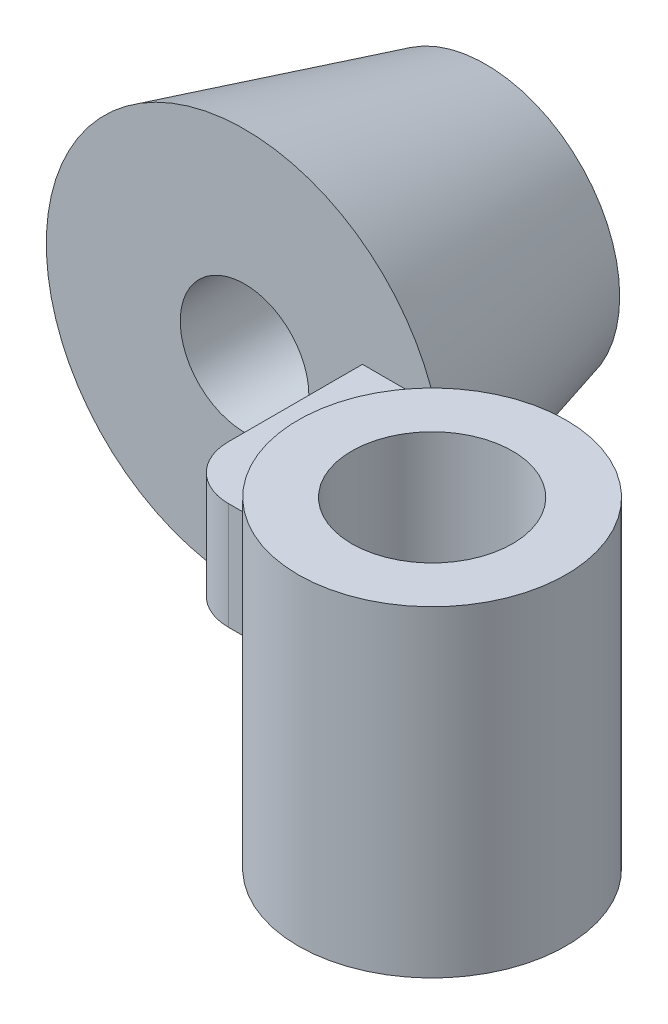
ISO-10303-21;
HEADER;
FILE_DESCRIPTION(('STEP AP214'),'2;1');
FILE_NAME('part.step','',(''),(''),'','','');
FILE_SCHEMA(('AUTOMOTIVE_DESIGN { 1 0 10303 214 1 1 1 1 }'));
ENDSEC;
DATA;
#1=APPLICATION_CONTEXT('core data for automotive mechanical design processes');
#2=APPLICATION_PROTOCOL_DEFINITION('international standard','automotive_design',2000,#1);
#3=PRODUCT_CONTEXT('',#1,'mechanical');
#4=PRODUCT('Part','Part','',(#3));
#5=PRODUCT_RELATED_PRODUCT_CATEGORY('part','',(#4));
#6=PRODUCT_DEFINITION_FORMATION('','',#4);
#7=PRODUCT_DEFINITION_CONTEXT('part definition',#1,'design');
#8=PRODUCT_DEFINITION('design','',#6,#7);
#9=PRODUCT_DEFINITION_SHAPE('','',#8);
#10=(LENGTH_UNIT() NAMED_UNIT(*) SI_UNIT(.MILLI.,.METRE.));
#11=(NAMED_UNIT(*) PLANE_ANGLE_UNIT() SI_UNIT($,.RADIAN.));
#12=(NAMED_UNIT(*) SI_UNIT($,.STERADIAN.) SOLID_ANGLE_UNIT());
#13=UNCERTAINTY_MEASURE_WITH_UNIT(LENGTH_MEASURE(1.E-05),#10,'distance_accuracy_value','');
#14=(GEOMETRIC_REPRESENTATION_CONTEXT(3) GLOBAL_UNCERTAINTY_ASSIGNED_CONTEXT((#13)) GLOBAL_UNIT_ASSIGNED_CONTEXT((#10,
#11,#12)) REPRESENTATION_CONTEXT('',''));
#15=CARTESIAN_POINT('',(0.,0.,0.));
#16=DIRECTION('',(0.,0.,1.));
#17=DIRECTION('',(1.,0.,0.));
#18=AXIS2_PLACEMENT_3D('',#15,#16,#17);
#19=CARTESIAN_POINT('',(0.,10.,35.));
#20=DIRECTION('',(0.,0.,-1.));
#21=DIRECTION('',(-1.,0.,0.));
#22=AXIS2_PLACEMENT_3D('',#19,#20,#21);
#23=PLANE('',#22);
#24=DIRECTION('',(0.,-1.,0.));
#25=VECTOR('',#24,1.);
#26=CARTESIAN_POINT('',(82.,30.,35.));
#27=LINE('',#26,#25);
#28=CARTESIAN_POINT('',(82.,10.,35.));
#29=VERTEX_POINT('',#28);
#30=CARTESIAN_POINT('',(82.,-10.,35.));
#31=VERTEX_POINT('',#30);
#32=EDGE_CURVE('E61',#29,#31,#27,.T.);
#33=ORIENTED_EDGE('',*,*,#32,.F.);
#34=DIRECTION('',(1.,0.,0.));
#35=VECTOR('',#34,1.);
#36=CARTESIAN_POINT('',(0.,10.,35.));
#37=LINE('',#36,#35);
#38=CARTESIAN_POINT('',(69.,10.,35.));
#39=VERTEX_POINT('',#38);
#40=EDGE_CURVE('E141',#39,#29,#37,.T.);
#41=ORIENTED_EDGE('',*,*,#40,.F.);
#42=DIRECTION('',(0.,-1.,0.));
#43=VECTOR('',#42,1.);
#44=CARTESIAN_POINT('',(69.,10.,35.));
#45=LINE('',#44,#43);
#46=CARTESIAN_POINT('',(69.,-10.,35.));
#47=VERTEX_POINT('',#46);
#48=EDGE_CURVE('E204',#39,#47,#45,.T.);
#49=ORIENTED_EDGE('',*,*,#48,.T.);
#50=DIRECTION('',(1.,0.,0.));
#51=VECTOR('',#50,1.);
#52=CARTESIAN_POINT('',(0.,-10.,35.));
#53=LINE('',#52,#51);
#54=EDGE_CURVE('E123',#47,#31,#53,.T.);
#55=ORIENTED_EDGE('',*,*,#54,.T.);
#56=EDGE_LOOP('',(#33,#41,#49,#55));
#57=FACE_BOUND('',#56,.T.);
#58=ADVANCED_FACE('F45',(#57),#23,.F.);
#59=CARTESIAN_POINT('',(0.,10.,25.));
#60=DIRECTION('',(0.,0.,-1.));
#61=DIRECTION('',(-1.,0.,0.));
#62=AXIS2_PLACEMENT_3D('',#59,#60,#61);
#63=PLANE('',#62);
#64=DIRECTION('',(1.,0.,0.));
#65=VECTOR('',#64,1.);
#66=CARTESIAN_POINT('',(0.,10.,25.));
#67=LINE('',#66,#65);
#68=CARTESIAN_POINT('',(80.3026917386518,10.,25.));
#69=VERTEX_POINT('',#68);
#70=CARTESIAN_POINT('',(84.0871215252208,10.,25.));
#71=VERTEX_POINT('',#70);
#72=EDGE_CURVE('E128',#69,#71,#67,.T.);
#73=ORIENTED_EDGE('',*,*,#72,.T.);
#74=DIRECTION('',(0.,-1.,0.));
#75=VECTOR('',#74,1.);
#76=CARTESIAN_POINT('',(84.0871215252208,30.,25.));
#77=LINE('',#76,#75);
#78=CARTESIAN_POINT('',(84.0871215252208,-10.,25.));
#79=VERTEX_POINT('',#78);
#80=EDGE_CURVE('E126',#71,#79,#77,.T.);
#81=ORIENTED_EDGE('',*,*,#80,.T.);
#82=DIRECTION('',(1.,0.,0.));
#83=VECTOR('',#82,1.);
#84=CARTESIAN_POINT('',(0.,-10.,25.));
#85=LINE('',#84,#83);
#86=CARTESIAN_POINT('',(80.3026917386518,-10.,25.));
#87=VERTEX_POINT('',#86);
#88=EDGE_CURVE('E113',#87,#79,#85,.T.);
#89=ORIENTED_EDGE('',*,*,#88,.F.);
#90=DIRECTION('',(0.,-1.,0.));
#91=VECTOR('',#90,1.);
#92=CARTESIAN_POINT('',(80.3026917386518,10.,25.));
#93=LINE('',#92,#91);
#94=EDGE_CURVE('E196',#87,#69,#93,.F.);
#95=ORIENTED_EDGE('',*,*,#94,.T.);
#96=EDGE_LOOP('',(#73,#81,#89,#95));
#97=FACE_BOUND('',#96,.T.);
#98=ADVANCED_FACE('F127',(#97),#63,.T.);
#99=CARTESIAN_POINT('',(0.,10.,0.));
#100=DIRECTION('',(0.,1.,0.));
#101=DIRECTION('',(0.,0.,1.));
#102=AXIS2_PLACEMENT_3D('',#99,#100,#101);
#103=PLANE('',#102);
#104=ORIENTED_EDGE('',*,*,#40,.T.);
#105=CARTESIAN_POINT('',(107.,10.,35.));
#106=DIRECTION('',(0.,1.,0.));
#107=DIRECTION('',(0.,0.,1.));
#108=AXIS2_PLACEMENT_3D('',#105,#106,#107);
#109=CIRCLE('',#108,25.);
#110=EDGE_CURVE('E68',#29,#71,#109,.F.);
#111=ORIENTED_EDGE('',*,*,#110,.T.);
#112=ORIENTED_EDGE('',*,*,#72,.F.);
#113=CARTESIAN_POINT('',(80.3026917386518,10.,19.));
#114=DIRECTION('',(0.,1.,0.));
#115=DIRECTION('',(0.,0.,1.));
#116=AXIS2_PLACEMENT_3D('',#113,#114,#115);
#117=CIRCLE('',#116,6.);
#118=CARTESIAN_POINT('',(74.5071367809174,10.,20.5529142706151));
#119=VERTEX_POINT('',#118);
#120=EDGE_CURVE('E201',#69,#119,#117,.F.);
#121=ORIENTED_EDGE('',*,*,#120,.T.);
#122=DIRECTION('',(0.258819045102521,0.,0.965925826289068));
#123=VECTOR('',#122,1.);
#124=CARTESIAN_POINT('',(64.3778764305631,10.,-17.25));
#125=LINE('',#124,#123);
#126=CARTESIAN_POINT('',(69.,10.,0.));
#127=VERTEX_POINT('',#126);
#128=EDGE_CURVE('E147',#127,#119,#125,.T.);
#129=ORIENTED_EDGE('',*,*,#128,.F.);
#130=DIRECTION('',(1.,0.,0.));
#131=VECTOR('',#130,1.);
#132=CARTESIAN_POINT('',(0.,10.,0.));
#133=LINE('',#132,#131);
#134=CARTESIAN_POINT('',(59.,10.,0.));
#135=VERTEX_POINT('',#134);
#136=EDGE_CURVE('E151',#135,#127,#133,.T.);
#137=ORIENTED_EDGE('',*,*,#136,.F.);
#138=DIRECTION('',(0.,0.,1.));
#139=VECTOR('',#138,1.);
#140=CARTESIAN_POINT('',(59.,10.,0.));
#141=LINE('',#140,#139);
#142=CARTESIAN_POINT('',(59.,10.,25.));
#143=VERTEX_POINT('',#142);
#144=EDGE_CURVE('E154',#135,#143,#141,.T.);
#145=ORIENTED_EDGE('',*,*,#144,.T.);
#146=CARTESIAN_POINT('',(69.,10.,25.));
#147=DIRECTION('',(0.,1.,0.));
#148=DIRECTION('',(0.,0.,1.));
#149=AXIS2_PLACEMENT_3D('',#146,#147,#148);
#150=CIRCLE('',#149,10.);
#151=EDGE_CURVE('E54',#143,#39,#150,.T.);
#152=ORIENTED_EDGE('',*,*,#151,.T.);
#153=EDGE_LOOP('',(#104,#111,#112,#121,#129,#137,#145,#152));
#154=FACE_BOUND('',#153,.T.);
#155=ADVANCED_FACE('F215',(#154),#103,.T.);
#156=CARTESIAN_POINT('',(0.,-10.,0.));
#157=DIRECTION('',(0.,1.,0.));
#158=DIRECTION('',(0.,0.,1.));
#159=AXIS2_PLACEMENT_3D('',#156,#157,#158);
#160=PLANE('',#159);
#161=CARTESIAN_POINT('',(107.,-10.,35.));
#162=DIRECTION('',(0.,1.,0.));
#163=DIRECTION('',(0.,0.,1.));
#164=AXIS2_PLACEMENT_3D('',#161,#162,#163);
#165=CIRCLE('',#164,25.);
#166=EDGE_CURVE('E11',#31,#79,#165,.F.);
#167=ORIENTED_EDGE('',*,*,#166,.F.);
#168=ORIENTED_EDGE('',*,*,#54,.F.);
#169=CARTESIAN_POINT('',(69.,-10.,25.));
#170=DIRECTION('',(0.,1.,0.));
#171=DIRECTION('',(0.,0.,1.));
#172=AXIS2_PLACEMENT_3D('',#169,#170,#171);
#173=CIRCLE('',#172,10.);
#174=CARTESIAN_POINT('',(59.,-10.,25.));
#175=VERTEX_POINT('',#174);
#176=EDGE_CURVE('E208',#47,#175,#173,.F.);
#177=ORIENTED_EDGE('',*,*,#176,.T.);
#178=DIRECTION('',(0.,0.,1.));
#179=VECTOR('',#178,1.);
#180=CARTESIAN_POINT('',(59.,-10.,0.));
#181=LINE('',#180,#179);
#182=CARTESIAN_POINT('',(59.,-10.,0.));
#183=VERTEX_POINT('',#182);
#184=EDGE_CURVE('E144',#183,#175,#181,.T.);
#185=ORIENTED_EDGE('',*,*,#184,.F.);
#186=DIRECTION('',(1.,0.,0.));
#187=VECTOR('',#186,1.);
#188=CARTESIAN_POINT('',(0.,-10.,0.));
#189=LINE('',#188,#187);
#190=CARTESIAN_POINT('',(69.,-10.,0.));
#191=VERTEX_POINT('',#190);
#192=EDGE_CURVE('E163',#183,#191,#189,.T.);
#193=ORIENTED_EDGE('',*,*,#192,.T.);
#194=DIRECTION('',(0.258819045102521,0.,0.965925826289068));
#195=VECTOR('',#194,1.);
#196=CARTESIAN_POINT('',(64.3778764305631,-10.,-17.25));
#197=LINE('',#196,#195);
#198=CARTESIAN_POINT('',(74.5071367809174,-10.,20.5529142706151));
#199=VERTEX_POINT('',#198);
#200=EDGE_CURVE('E122',#191,#199,#197,.T.);
#201=ORIENTED_EDGE('',*,*,#200,.T.);
#202=CARTESIAN_POINT('',(80.3026917386518,-10.,19.));
#203=DIRECTION('',(0.,1.,0.));
#204=DIRECTION('',(0.,0.,1.));
#205=AXIS2_PLACEMENT_3D('',#202,#203,#204);
#206=CIRCLE('',#205,6.);
#207=EDGE_CURVE('E118',#199,#87,#206,.T.);
#208=ORIENTED_EDGE('',*,*,#207,.T.);
#209=ORIENTED_EDGE('',*,*,#88,.T.);
#210=EDGE_LOOP('',(#167,#168,#177,#185,#193,#201,#208,#209));
#211=FACE_BOUND('',#210,.T.);
#212=ADVANCED_FACE('F115',(#211),#160,.F.);
#213=CARTESIAN_POINT('',(37.,0.,0.));
#214=DIRECTION('',(0.,0.,1.));
#215=DIRECTION('',(1.,0.,0.));
#216=AXIS2_PLACEMENT_3D('',#213,#214,#215);
#217=CYLINDRICAL_SURFACE('',#216,12.);
#218=CARTESIAN_POINT('',(37.,0.,0.));
#219=DIRECTION('',(0.,0.,1.));
#220=DIRECTION('',(1.,0.,0.));
#221=AXIS2_PLACEMENT_3D('',#218,#219,#220);
#222=CIRCLE('',#221,12.);
#223=CARTESIAN_POINT('',(49.,0.,0.));
#224=VERTEX_POINT('',#223);
#225=EDGE_CURVE('E176',#224,#224,#222,.T.);
#226=ORIENTED_EDGE('',*,*,#225,.T.);
#227=EDGE_LOOP('',(#226));
#228=FACE_BOUND('',#227,.T.);
#229=CARTESIAN_POINT('',(37.,0.,-45.));
#230=DIRECTION('',(0.,0.,1.));
#231=DIRECTION('',(1.,0.,0.));
#232=AXIS2_PLACEMENT_3D('',#229,#230,#231);
#233=CIRCLE('',#232,12.);
#234=CARTESIAN_POINT('',(49.,0.,-45.));
#235=VERTEX_POINT('',#234);
#236=EDGE_CURVE('E188',#235,#235,#233,.T.);
#237=ORIENTED_EDGE('',*,*,#236,.F.);
#238=EDGE_LOOP('',(#237));
#239=FACE_BOUND('',#238,.T.);
#240=ADVANCED_FACE('F260',(#228,#239),#217,.F.);
#241=CARTESIAN_POINT('',(0.,0.,-45.));
#242=DIRECTION('',(0.,0.,1.));
#243=DIRECTION('',(1.,0.,0.));
#244=AXIS2_PLACEMENT_3D('',#241,#242,#243);
#245=PLANE('',#244);
#246=CARTESIAN_POINT('',(37.,0.,-45.));
#247=DIRECTION('',(0.,0.,1.));
#248=DIRECTION('',(1.,0.,0.));
#249=AXIS2_PLACEMENT_3D('',#246,#247,#248);
#250=CIRCLE('',#249,25.);
#251=CARTESIAN_POINT('',(62.,0.,-45.));
#252=VERTEX_POINT('',#251);
#253=EDGE_CURVE('E184',#252,#252,#250,.T.);
#254=ORIENTED_EDGE('',*,*,#253,.F.);
#255=EDGE_LOOP('',(#254));
#256=FACE_BOUND('',#255,.T.);
#257=ORIENTED_EDGE('',*,*,#236,.T.);
#258=EDGE_LOOP('',(#257));
#259=FACE_BOUND('',#258,.T.);
#260=ADVANCED_FACE('F257',(#256,#259),#245,.F.);
#261=CARTESIAN_POINT('',(37.,0.,-45.));
#262=DIRECTION('',(0.,0.,1.));
#263=DIRECTION('',(1.,0.,0.));
#264=AXIS2_PLACEMENT_3D('',#261,#262,#263);
#265=CONICAL_SURFACE('',#264,25.,0.260602391747341);
#266=CARTESIAN_POINT('',(37.,0.,0.));
#267=DIRECTION('',(0.,0.,1.));
#268=DIRECTION('',(1.,0.,0.));
#269=AXIS2_PLACEMENT_3D('',#266,#267,#268);
#270=CIRCLE('',#269,37.);
#271=CARTESIAN_POINT('',(74.,0.,0.));
#272=VERTEX_POINT('',#271);
#273=EDGE_CURVE('E180',#272,#272,#270,.T.);
#274=ORIENTED_EDGE('',*,*,#273,.F.);
#275=EDGE_LOOP('',(#274));
#276=FACE_BOUND('',#275,.T.);
#277=ORIENTED_EDGE('',*,*,#253,.T.);
#278=EDGE_LOOP('',(#277));
#279=FACE_BOUND('',#278,.T.);
#280=ADVANCED_FACE('F254',(#276,#279),#265,.T.);
#281=CARTESIAN_POINT('',(0.,0.,0.));
#282=DIRECTION('',(0.,0.,-1.));
#283=DIRECTION('',(-1.,0.,0.));
#284=AXIS2_PLACEMENT_3D('',#281,#282,#283);
#285=PLANE('',#284);
#286=DIRECTION('',(0.,-1.,0.));
#287=VECTOR('',#286,1.);
#288=CARTESIAN_POINT('',(59.,10.,0.));
#289=LINE('',#288,#287);
#290=EDGE_CURVE('E158',#135,#183,#289,.T.);
#291=ORIENTED_EDGE('',*,*,#290,.F.);
#292=ORIENTED_EDGE('',*,*,#136,.T.);
#293=DIRECTION('',(0.,-1.,0.));
#294=VECTOR('',#293,1.);
#295=CARTESIAN_POINT('',(69.,10.,0.));
#296=LINE('',#295,#294);
#297=EDGE_CURVE('E173',#127,#191,#296,.T.);
#298=ORIENTED_EDGE('',*,*,#297,.T.);
#299=ORIENTED_EDGE('',*,*,#192,.F.);
#300=EDGE_LOOP('',(#291,#292,#298,#299));
#301=FACE_BOUND('',#300,.T.);
#302=ORIENTED_EDGE('',*,*,#225,.F.);
#303=EDGE_LOOP('',(#302));
#304=FACE_BOUND('',#303,.T.);
#305=ORIENTED_EDGE('',*,*,#273,.T.);
#306=EDGE_LOOP('',(#305));
#307=FACE_BOUND('',#306,.T.);
#308=ADVANCED_FACE('F225',(#301,#304,#307),#285,.F.);
#309=CARTESIAN_POINT('',(64.3778764305631,10.,-17.25));
#310=DIRECTION('',(0.965925826289068,0.,-0.258819045102521));
#311=DIRECTION('',(-0.258819045102521,0.,-0.965925826289068));
#312=AXIS2_PLACEMENT_3D('',#309,#310,#311);
#313=PLANE('',#312);
#314=ORIENTED_EDGE('',*,*,#128,.T.);
#315=DIRECTION('',(0.,-1.,0.));
#316=VECTOR('',#315,1.);
#317=CARTESIAN_POINT('',(74.5071367809174,-10.,20.5529142706151));
#318=LINE('',#317,#316);
#319=EDGE_CURVE('E192',#119,#199,#318,.T.);
#320=ORIENTED_EDGE('',*,*,#319,.T.);
#321=ORIENTED_EDGE('',*,*,#200,.F.);
#322=ORIENTED_EDGE('',*,*,#297,.F.);
#323=EDGE_LOOP('',(#314,#320,#321,#322));
#324=FACE_BOUND('',#323,.T.);
#325=ADVANCED_FACE('F230',(#324),#313,.T.);
#326=CARTESIAN_POINT('',(59.,10.,0.));
#327=DIRECTION('',(1.,0.,0.));
#328=DIRECTION('',(0.,0.,-1.));
#329=AXIS2_PLACEMENT_3D('',#326,#327,#328);
#330=PLANE('',#329);
#331=ORIENTED_EDGE('',*,*,#184,.T.);
#332=DIRECTION('',(0.,-1.,0.));
#333=VECTOR('',#332,1.);
#334=CARTESIAN_POINT('',(59.,10.,25.));
#335=LINE('',#334,#333);
#336=EDGE_CURVE('E211',#175,#143,#335,.F.);
#337=ORIENTED_EDGE('',*,*,#336,.T.);
#338=ORIENTED_EDGE('',*,*,#144,.F.);
#339=ORIENTED_EDGE('',*,*,#290,.T.);
#340=EDGE_LOOP('',(#331,#337,#338,#339));
#341=FACE_BOUND('',#340,.T.);
#342=ADVANCED_FACE('F223',(#341),#330,.F.);
#343=CARTESIAN_POINT('',(80.3026917386518,10.,19.));
#344=DIRECTION('',(0.,1.,0.));
#345=DIRECTION('',(0.,0.,1.));
#346=AXIS2_PLACEMENT_3D('',#343,#344,#345);
#347=CYLINDRICAL_SURFACE('',#346,6.);
#348=ORIENTED_EDGE('',*,*,#120,.F.);
#349=ORIENTED_EDGE('',*,*,#94,.F.);
#350=ORIENTED_EDGE('',*,*,#207,.F.);
#351=ORIENTED_EDGE('',*,*,#319,.F.);
#352=EDGE_LOOP('',(#348,#349,#350,#351));
#353=FACE_BOUND('',#352,.T.);
#354=ADVANCED_FACE('F235',(#353),#347,.F.);
#355=CARTESIAN_POINT('',(69.,10.,25.));
#356=DIRECTION('',(0.,-1.,0.));
#357=DIRECTION('',(0.,0.,-1.));
#358=AXIS2_PLACEMENT_3D('',#355,#356,#357);
#359=CYLINDRICAL_SURFACE('',#358,10.);
#360=ORIENTED_EDGE('',*,*,#151,.F.);
#361=ORIENTED_EDGE('',*,*,#336,.F.);
#362=ORIENTED_EDGE('',*,*,#176,.F.);
#363=ORIENTED_EDGE('',*,*,#48,.F.);
#364=EDGE_LOOP('',(#360,#361,#362,#363));
#365=FACE_BOUND('',#364,.T.);
#366=ADVANCED_FACE('F47',(#365),#359,.T.);
#367=CARTESIAN_POINT('',(107.,30.,35.));
#368=DIRECTION('',(0.,1.,0.));
#369=DIRECTION('',(0.,0.,1.));
#370=AXIS2_PLACEMENT_3D('',#367,#368,#369);
#371=PLANE('',#370);
#372=CARTESIAN_POINT('',(107.,30.,35.));
#373=DIRECTION('',(0.,1.,0.));
#374=DIRECTION('',(0.,0.,1.));
#375=AXIS2_PLACEMENT_3D('',#372,#373,#374);
#376=CIRCLE('',#375,25.);
#377=CARTESIAN_POINT('',(107.,30.,60.));
#378=VERTEX_POINT('',#377);
#379=EDGE_CURVE('E131',#378,#378,#376,.T.);
#380=ORIENTED_EDGE('',*,*,#379,.T.);
#381=EDGE_LOOP('',(#380));
#382=FACE_BOUND('',#381,.T.);
#383=CARTESIAN_POINT('',(107.,30.,35.));
#384=DIRECTION('',(0.,1.,0.));
#385=DIRECTION('',(0.,0.,1.));
#386=AXIS2_PLACEMENT_3D('',#383,#384,#385);
#387=CIRCLE('',#386,15.);
#388=CARTESIAN_POINT('',(107.,30.,50.));
#389=VERTEX_POINT('',#388);
#390=EDGE_CURVE('E441',#389,#389,#387,.T.);
#391=ORIENTED_EDGE('',*,*,#390,.F.);
#392=EDGE_LOOP('',(#391));
#393=FACE_BOUND('',#392,.T.);
#394=ADVANCED_FACE('F241',(#382,#393),#371,.T.);
#395=CARTESIAN_POINT('',(107.,30.,35.));
#396=DIRECTION('',(0.,-1.,0.));
#397=DIRECTION('',(0.,0.,-1.));
#398=AXIS2_PLACEMENT_3D('',#395,#396,#397);
#399=CYLINDRICAL_SURFACE('',#398,25.);
#400=ORIENTED_EDGE('',*,*,#110,.F.);
#401=ORIENTED_EDGE('',*,*,#32,.T.);
#402=ORIENTED_EDGE('',*,*,#166,.T.);
#403=ORIENTED_EDGE('',*,*,#80,.F.);
#404=EDGE_LOOP('',(#400,#401,#402,#403));
#405=FACE_BOUND('',#404,.T.);
#406=ORIENTED_EDGE('',*,*,#379,.F.);
#407=EDGE_LOOP('',(#406));
#408=FACE_BOUND('',#407,.T.);
#409=CARTESIAN_POINT('',(107.,-30.,35.));
#410=DIRECTION('',(0.,1.,0.));
#411=DIRECTION('',(0.,0.,1.));
#412=AXIS2_PLACEMENT_3D('',#409,#410,#411);
#413=CIRCLE('',#412,25.);
#414=CARTESIAN_POINT('',(107.,-30.,60.));
#415=VERTEX_POINT('',#414);
#416=EDGE_CURVE('E446',#415,#415,#413,.T.);
#417=ORIENTED_EDGE('',*,*,#416,.T.);
#418=EDGE_LOOP('',(#417));
#419=FACE_BOUND('',#418,.T.);
#420=ADVANCED_FACE('F133',(#405,#408,#419),#399,.T.);
#421=CARTESIAN_POINT('',(107.,-30.,35.));
#422=DIRECTION('',(0.,1.,0.));
#423=DIRECTION('',(0.,0.,1.));
#424=AXIS2_PLACEMENT_3D('',#421,#422,#423);
#425=PLANE('',#424);
#426=CARTESIAN_POINT('',(107.,-30.,35.));
#427=DIRECTION('',(0.,1.,0.));
#428=DIRECTION('',(0.,0.,1.));
#429=AXIS2_PLACEMENT_3D('',#426,#427,#428);
#430=CIRCLE('',#429,15.);
#431=CARTESIAN_POINT('',(107.,-30.,50.));
#432=VERTEX_POINT('',#431);
#433=EDGE_CURVE('E444',#432,#432,#430,.T.);
#434=ORIENTED_EDGE('',*,*,#433,.T.);
#435=EDGE_LOOP('',(#434));
#436=FACE_BOUND('',#435,.T.);
#437=ORIENTED_EDGE('',*,*,#416,.F.);
#438=EDGE_LOOP('',(#437));
#439=FACE_BOUND('',#438,.T.);
#440=ADVANCED_FACE('F341',(#436,#439),#425,.F.);
#441=CARTESIAN_POINT('',(107.,-37.,35.));
#442=DIRECTION('',(0.,1.,0.));
#443=DIRECTION('',(0.,0.,1.));
#444=AXIS2_PLACEMENT_3D('',#441,#442,#443);
#445=CYLINDRICAL_SURFACE('',#444,15.);
#446=ORIENTED_EDGE('',*,*,#390,.T.);
#447=EDGE_LOOP('',(#446));
#448=FACE_BOUND('',#447,.T.);
#449=ORIENTED_EDGE('',*,*,#433,.F.);
#450=EDGE_LOOP('',(#449));
#451=FACE_BOUND('',#450,.T.);
#452=ADVANCED_FACE('F351',(#448,#451),#445,.F.);
#453=CLOSED_SHELL('',(#58,#98,#155,#212,#240,#260,#280,#308,#325,#342,#354,#366,#394,#420,#440,#452));
#454=MANIFOLD_SOLID_BREP('B2',#453);
#455=ADVANCED_BREP_SHAPE_REPRESENTATION('',(#18,#454),#14);
#456=SHAPE_DEFINITION_REPRESENTATION(#9,#455);
ENDSEC;
END-ISO-10303-21;
